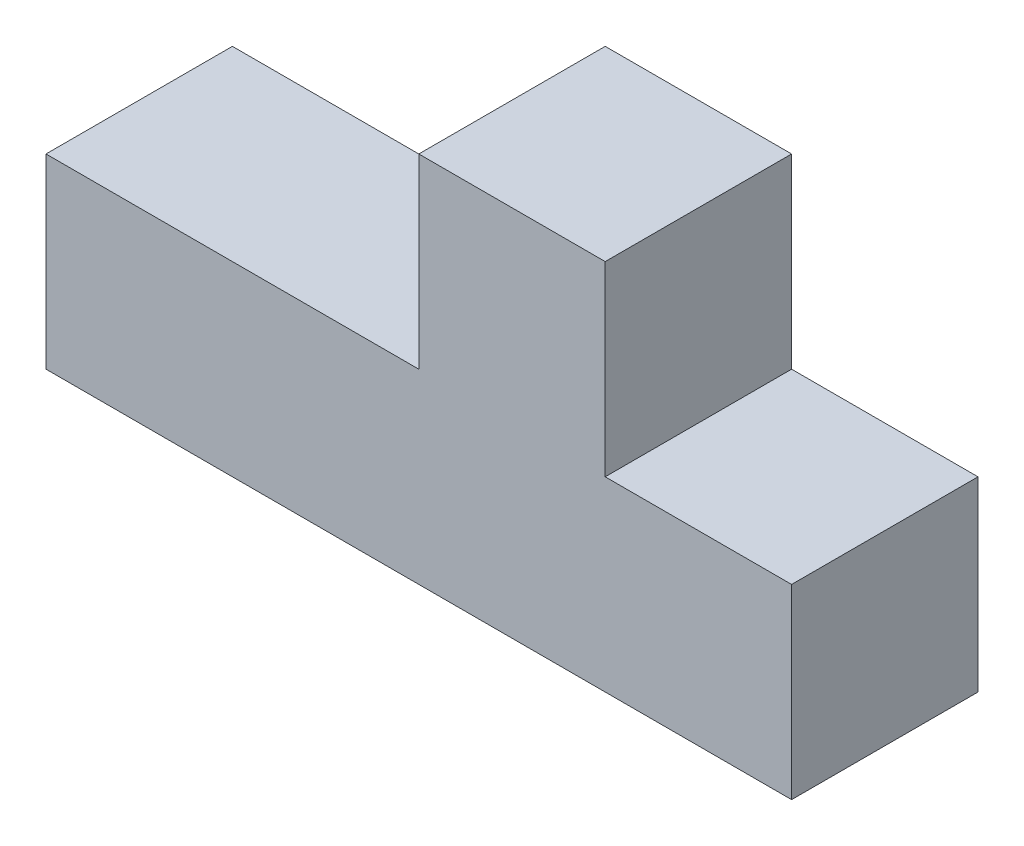
ISO-10303-21;
HEADER;
FILE_DESCRIPTION(('STEP AP214'),'2;1');
FILE_NAME('part.step','',(''),(''),'','','');
FILE_SCHEMA(('AUTOMOTIVE_DESIGN { 1 0 10303 214 1 1 1 1 }'));
ENDSEC;
DATA;
#1=APPLICATION_CONTEXT('core data for automotive mechanical design processes');
#2=APPLICATION_PROTOCOL_DEFINITION('international standard','automotive_design',2000,#1);
#3=PRODUCT_CONTEXT('',#1,'mechanical');
#4=PRODUCT('Part','Part','',(#3));
#5=PRODUCT_RELATED_PRODUCT_CATEGORY('part','',(#4));
#6=PRODUCT_DEFINITION_FORMATION('','',#4);
#7=PRODUCT_DEFINITION_CONTEXT('part definition',#1,'design');
#8=PRODUCT_DEFINITION('design','',#6,#7);
#9=PRODUCT_DEFINITION_SHAPE('','',#8);
#10=(LENGTH_UNIT() NAMED_UNIT(*) SI_UNIT(.MILLI.,.METRE.));
#11=(NAMED_UNIT(*) PLANE_ANGLE_UNIT() SI_UNIT($,.RADIAN.));
#12=(NAMED_UNIT(*) SI_UNIT($,.STERADIAN.) SOLID_ANGLE_UNIT());
#13=UNCERTAINTY_MEASURE_WITH_UNIT(LENGTH_MEASURE(1.E-05),#10,'distance_accuracy_value','');
#14=(GEOMETRIC_REPRESENTATION_CONTEXT(3) GLOBAL_UNCERTAINTY_ASSIGNED_CONTEXT((#13)) GLOBAL_UNIT_ASSIGNED_CONTEXT((#10,
#11,#12)) REPRESENTATION_CONTEXT('',''));
#15=CARTESIAN_POINT('',(0.,0.,0.));
#16=DIRECTION('',(0.,0.,1.));
#17=DIRECTION('',(1.,0.,0.));
#18=AXIS2_PLACEMENT_3D('',#15,#16,#17);
#19=CARTESIAN_POINT('',(0.,25.4,25.4));
#20=DIRECTION('',(1.,0.,0.));
#21=DIRECTION('',(0.,0.,-1.));
#22=AXIS2_PLACEMENT_3D('',#19,#20,#21);
#23=PLANE('',#22);
#24=DIRECTION('',(0.,-1.,0.));
#25=VECTOR('',#24,1.);
#26=CARTESIAN_POINT('',(0.,25.4,0.));
#27=LINE('',#26,#25);
#28=CARTESIAN_POINT('',(0.,25.4,0.));
#29=VERTEX_POINT('',#28);
#30=CARTESIAN_POINT('',(0.,0.,0.));
#31=VERTEX_POINT('',#30);
#32=EDGE_CURVE('E129',#29,#31,#27,.T.);
#33=ORIENTED_EDGE('',*,*,#32,.T.);
#34=DIRECTION('',(0.,0.,-1.));
#35=VECTOR('',#34,1.);
#36=CARTESIAN_POINT('',(0.,0.,25.4));
#37=LINE('',#36,#35);
#38=CARTESIAN_POINT('',(0.,0.,25.4));
#39=VERTEX_POINT('',#38);
#40=EDGE_CURVE('E11',#39,#31,#37,.T.);
#41=ORIENTED_EDGE('',*,*,#40,.F.);
#42=DIRECTION('',(0.,-1.,0.));
#43=VECTOR('',#42,1.);
#44=CARTESIAN_POINT('',(0.,25.4,25.4));
#45=LINE('',#44,#43);
#46=CARTESIAN_POINT('',(0.,25.4,25.4));
#47=VERTEX_POINT('',#46);
#48=EDGE_CURVE('E143',#47,#39,#45,.T.);
#49=ORIENTED_EDGE('',*,*,#48,.F.);
#50=DIRECTION('',(0.,0.,-1.));
#51=VECTOR('',#50,1.);
#52=CARTESIAN_POINT('',(0.,25.4,25.4));
#53=LINE('',#52,#51);
#54=EDGE_CURVE('E125',#47,#29,#53,.T.);
#55=ORIENTED_EDGE('',*,*,#54,.T.);
#56=EDGE_LOOP('',(#33,#41,#49,#55));
#57=FACE_BOUND('',#56,.T.);
#58=ADVANCED_FACE('F33',(#57),#23,.F.);
#59=CARTESIAN_POINT('',(0.,0.,25.4));
#60=DIRECTION('',(0.,1.,0.));
#61=DIRECTION('',(0.,0.,1.));
#62=AXIS2_PLACEMENT_3D('',#59,#60,#61);
#63=PLANE('',#62);
#64=DIRECTION('',(1.,0.,0.));
#65=VECTOR('',#64,1.);
#66=CARTESIAN_POINT('',(0.,0.,0.));
#67=LINE('',#66,#65);
#68=CARTESIAN_POINT('',(101.6,0.,0.));
#69=VERTEX_POINT('',#68);
#70=EDGE_CURVE('E132',#31,#69,#67,.T.);
#71=ORIENTED_EDGE('',*,*,#70,.T.);
#72=DIRECTION('',(0.,0.,-1.));
#73=VECTOR('',#72,1.);
#74=CARTESIAN_POINT('',(101.6,0.,25.4));
#75=LINE('',#74,#73);
#76=CARTESIAN_POINT('',(101.6,0.,25.4));
#77=VERTEX_POINT('',#76);
#78=EDGE_CURVE('E41',#77,#69,#75,.T.);
#79=ORIENTED_EDGE('',*,*,#78,.F.);
#80=DIRECTION('',(1.,0.,0.));
#81=VECTOR('',#80,1.);
#82=CARTESIAN_POINT('',(0.,0.,25.4));
#83=LINE('',#82,#81);
#84=EDGE_CURVE('E92',#39,#77,#83,.T.);
#85=ORIENTED_EDGE('',*,*,#84,.F.);
#86=ORIENTED_EDGE('',*,*,#40,.T.);
#87=EDGE_LOOP('',(#71,#79,#85,#86));
#88=FACE_BOUND('',#87,.T.);
#89=ADVANCED_FACE('F178',(#88),#63,.F.);
#90=CARTESIAN_POINT('',(101.6,0.,25.4));
#91=DIRECTION('',(-1.,0.,0.));
#92=DIRECTION('',(0.,0.,1.));
#93=AXIS2_PLACEMENT_3D('',#90,#91,#92);
#94=PLANE('',#93);
#95=DIRECTION('',(0.,1.,0.));
#96=VECTOR('',#95,1.);
#97=CARTESIAN_POINT('',(101.6,0.,0.));
#98=LINE('',#97,#96);
#99=CARTESIAN_POINT('',(101.6,25.4,0.));
#100=VERTEX_POINT('',#99);
#101=EDGE_CURVE('E134',#69,#100,#98,.T.);
#102=ORIENTED_EDGE('',*,*,#101,.T.);
#103=DIRECTION('',(0.,0.,-1.));
#104=VECTOR('',#103,1.);
#105=CARTESIAN_POINT('',(101.6,25.4,25.4));
#106=LINE('',#105,#104);
#107=CARTESIAN_POINT('',(101.6,25.4,25.4));
#108=VERTEX_POINT('',#107);
#109=EDGE_CURVE('E150',#108,#100,#106,.T.);
#110=ORIENTED_EDGE('',*,*,#109,.F.);
#111=DIRECTION('',(0.,1.,0.));
#112=VECTOR('',#111,1.);
#113=CARTESIAN_POINT('',(101.6,0.,25.4));
#114=LINE('',#113,#112);
#115=EDGE_CURVE('E158',#77,#108,#114,.T.);
#116=ORIENTED_EDGE('',*,*,#115,.F.);
#117=ORIENTED_EDGE('',*,*,#78,.T.);
#118=EDGE_LOOP('',(#102,#110,#116,#117));
#119=FACE_BOUND('',#118,.T.);
#120=ADVANCED_FACE('F156',(#119),#94,.F.);
#121=CARTESIAN_POINT('',(101.6,25.4,25.4));
#122=DIRECTION('',(0.,-1.,0.));
#123=DIRECTION('',(0.,0.,-1.));
#124=AXIS2_PLACEMENT_3D('',#121,#122,#123);
#125=PLANE('',#124);
#126=DIRECTION('',(-1.,0.,0.));
#127=VECTOR('',#126,1.);
#128=CARTESIAN_POINT('',(101.6,25.4,0.));
#129=LINE('',#128,#127);
#130=CARTESIAN_POINT('',(76.2,25.4,0.));
#131=VERTEX_POINT('',#130);
#132=EDGE_CURVE('E136',#100,#131,#129,.T.);
#133=ORIENTED_EDGE('',*,*,#132,.T.);
#134=DIRECTION('',(0.,0.,-1.));
#135=VECTOR('',#134,1.);
#136=CARTESIAN_POINT('',(76.2,25.4,25.4));
#137=LINE('',#136,#135);
#138=CARTESIAN_POINT('',(76.2,25.4,25.4));
#139=VERTEX_POINT('',#138);
#140=EDGE_CURVE('E147',#139,#131,#137,.T.);
#141=ORIENTED_EDGE('',*,*,#140,.F.);
#142=DIRECTION('',(-1.,0.,0.));
#143=VECTOR('',#142,1.);
#144=CARTESIAN_POINT('',(101.6,25.4,25.4));
#145=LINE('',#144,#143);
#146=EDGE_CURVE('E170',#108,#139,#145,.T.);
#147=ORIENTED_EDGE('',*,*,#146,.F.);
#148=ORIENTED_EDGE('',*,*,#109,.T.);
#149=EDGE_LOOP('',(#133,#141,#147,#148));
#150=FACE_BOUND('',#149,.T.);
#151=ADVANCED_FACE('F166',(#150),#125,.F.);
#152=CARTESIAN_POINT('',(76.2,25.4,25.4));
#153=DIRECTION('',(-1.,0.,0.));
#154=DIRECTION('',(0.,0.,1.));
#155=AXIS2_PLACEMENT_3D('',#152,#153,#154);
#156=PLANE('',#155);
#157=DIRECTION('',(0.,1.,0.));
#158=VECTOR('',#157,1.);
#159=CARTESIAN_POINT('',(76.2,25.4,0.));
#160=LINE('',#159,#158);
#161=CARTESIAN_POINT('',(76.2,50.8,0.));
#162=VERTEX_POINT('',#161);
#163=EDGE_CURVE('E138',#131,#162,#160,.T.);
#164=ORIENTED_EDGE('',*,*,#163,.T.);
#165=DIRECTION('',(0.,0.,-1.));
#166=VECTOR('',#165,1.);
#167=CARTESIAN_POINT('',(76.2,50.8,25.4));
#168=LINE('',#167,#166);
#169=CARTESIAN_POINT('',(76.2,50.8,25.4));
#170=VERTEX_POINT('',#169);
#171=EDGE_CURVE('E120',#170,#162,#168,.T.);
#172=ORIENTED_EDGE('',*,*,#171,.F.);
#173=DIRECTION('',(0.,1.,0.));
#174=VECTOR('',#173,1.);
#175=CARTESIAN_POINT('',(76.2,25.4,25.4));
#176=LINE('',#175,#174);
#177=EDGE_CURVE('E111',#139,#170,#176,.T.);
#178=ORIENTED_EDGE('',*,*,#177,.F.);
#179=ORIENTED_EDGE('',*,*,#140,.T.);
#180=EDGE_LOOP('',(#164,#172,#178,#179));
#181=FACE_BOUND('',#180,.T.);
#182=ADVANCED_FACE('F169',(#181),#156,.F.);
#183=CARTESIAN_POINT('',(76.2,50.8,25.4));
#184=DIRECTION('',(0.,-1.,0.));
#185=DIRECTION('',(0.,0.,-1.));
#186=AXIS2_PLACEMENT_3D('',#183,#184,#185);
#187=PLANE('',#186);
#188=DIRECTION('',(-1.,0.,0.));
#189=VECTOR('',#188,1.);
#190=CARTESIAN_POINT('',(76.2,50.8,0.));
#191=LINE('',#190,#189);
#192=CARTESIAN_POINT('',(50.8,50.8,0.));
#193=VERTEX_POINT('',#192);
#194=EDGE_CURVE('E119',#162,#193,#191,.T.);
#195=ORIENTED_EDGE('',*,*,#194,.T.);
#196=DIRECTION('',(0.,0.,-1.));
#197=VECTOR('',#196,1.);
#198=CARTESIAN_POINT('',(50.8,50.8,25.4));
#199=LINE('',#198,#197);
#200=CARTESIAN_POINT('',(50.8,50.8,25.4));
#201=VERTEX_POINT('',#200);
#202=EDGE_CURVE('E116',#201,#193,#199,.T.);
#203=ORIENTED_EDGE('',*,*,#202,.F.);
#204=DIRECTION('',(-1.,0.,0.));
#205=VECTOR('',#204,1.);
#206=CARTESIAN_POINT('',(76.2,50.8,25.4));
#207=LINE('',#206,#205);
#208=EDGE_CURVE('E105',#170,#201,#207,.T.);
#209=ORIENTED_EDGE('',*,*,#208,.F.);
#210=ORIENTED_EDGE('',*,*,#171,.T.);
#211=EDGE_LOOP('',(#195,#203,#209,#210));
#212=FACE_BOUND('',#211,.T.);
#213=ADVANCED_FACE('F117',(#212),#187,.F.);
#214=CARTESIAN_POINT('',(50.8,50.8,25.4));
#215=DIRECTION('',(1.,0.,0.));
#216=DIRECTION('',(0.,0.,-1.));
#217=AXIS2_PLACEMENT_3D('',#214,#215,#216);
#218=PLANE('',#217);
#219=DIRECTION('',(0.,-1.,0.));
#220=VECTOR('',#219,1.);
#221=CARTESIAN_POINT('',(50.8,50.8,0.));
#222=LINE('',#221,#220);
#223=CARTESIAN_POINT('',(50.8,25.4,0.));
#224=VERTEX_POINT('',#223);
#225=EDGE_CURVE('E78',#193,#224,#222,.T.);
#226=ORIENTED_EDGE('',*,*,#225,.T.);
#227=DIRECTION('',(0.,0.,-1.));
#228=VECTOR('',#227,1.);
#229=CARTESIAN_POINT('',(50.8,25.4,25.4));
#230=LINE('',#229,#228);
#231=CARTESIAN_POINT('',(50.8,25.4,25.4));
#232=VERTEX_POINT('',#231);
#233=EDGE_CURVE('E121',#232,#224,#230,.T.);
#234=ORIENTED_EDGE('',*,*,#233,.F.);
#235=DIRECTION('',(0.,-1.,0.));
#236=VECTOR('',#235,1.);
#237=CARTESIAN_POINT('',(50.8,50.8,25.4));
#238=LINE('',#237,#236);
#239=EDGE_CURVE('E109',#201,#232,#238,.T.);
#240=ORIENTED_EDGE('',*,*,#239,.F.);
#241=ORIENTED_EDGE('',*,*,#202,.T.);
#242=EDGE_LOOP('',(#226,#234,#240,#241));
#243=FACE_BOUND('',#242,.T.);
#244=ADVANCED_FACE('F123',(#243),#218,.F.);
#245=CARTESIAN_POINT('',(50.8,25.4,25.4));
#246=DIRECTION('',(0.,-1.,0.));
#247=DIRECTION('',(0.,0.,-1.));
#248=AXIS2_PLACEMENT_3D('',#245,#246,#247);
#249=PLANE('',#248);
#250=DIRECTION('',(-1.,0.,0.));
#251=VECTOR('',#250,1.);
#252=CARTESIAN_POINT('',(50.8,25.4,0.));
#253=LINE('',#252,#251);
#254=EDGE_CURVE('E84',#224,#29,#253,.T.);
#255=ORIENTED_EDGE('',*,*,#254,.T.);
#256=ORIENTED_EDGE('',*,*,#54,.F.);
#257=DIRECTION('',(-1.,0.,0.));
#258=VECTOR('',#257,1.);
#259=CARTESIAN_POINT('',(50.8,25.4,25.4));
#260=LINE('',#259,#258);
#261=EDGE_CURVE('E49',#232,#47,#260,.T.);
#262=ORIENTED_EDGE('',*,*,#261,.F.);
#263=ORIENTED_EDGE('',*,*,#233,.T.);
#264=EDGE_LOOP('',(#255,#256,#262,#263));
#265=FACE_BOUND('',#264,.T.);
#266=ADVANCED_FACE('F194',(#265),#249,.F.);
#267=CARTESIAN_POINT('',(0.,0.,25.4));
#268=DIRECTION('',(0.,0.,1.));
#269=DIRECTION('',(1.,0.,0.));
#270=AXIS2_PLACEMENT_3D('',#267,#268,#269);
#271=PLANE('',#270);
#272=ORIENTED_EDGE('',*,*,#48,.T.);
#273=ORIENTED_EDGE('',*,*,#84,.T.);
#274=ORIENTED_EDGE('',*,*,#115,.T.);
#275=ORIENTED_EDGE('',*,*,#146,.T.);
#276=ORIENTED_EDGE('',*,*,#177,.T.);
#277=ORIENTED_EDGE('',*,*,#208,.T.);
#278=ORIENTED_EDGE('',*,*,#239,.T.);
#279=ORIENTED_EDGE('',*,*,#261,.T.);
#280=EDGE_LOOP('',(#272,#273,#274,#275,#276,#277,#278,#279));
#281=FACE_BOUND('',#280,.T.);
#282=ADVANCED_FACE('F107',(#281),#271,.T.);
#283=CARTESIAN_POINT('',(0.,0.,0.));
#284=DIRECTION('',(0.,0.,1.));
#285=DIRECTION('',(1.,0.,0.));
#286=AXIS2_PLACEMENT_3D('',#283,#284,#285);
#287=PLANE('',#286);
#288=ORIENTED_EDGE('',*,*,#32,.F.);
#289=ORIENTED_EDGE('',*,*,#254,.F.);
#290=ORIENTED_EDGE('',*,*,#225,.F.);
#291=ORIENTED_EDGE('',*,*,#194,.F.);
#292=ORIENTED_EDGE('',*,*,#163,.F.);
#293=ORIENTED_EDGE('',*,*,#132,.F.);
#294=ORIENTED_EDGE('',*,*,#101,.F.);
#295=ORIENTED_EDGE('',*,*,#70,.F.);
#296=EDGE_LOOP('',(#288,#289,#290,#291,#292,#293,#294,#295));
#297=FACE_BOUND('',#296,.T.);
#298=ADVANCED_FACE('F162',(#297),#287,.F.);
#299=CLOSED_SHELL('',(#58,#89,#120,#151,#182,#213,#244,#266,#282,#298));
#300=MANIFOLD_SOLID_BREP('B2',#299);
#301=ADVANCED_BREP_SHAPE_REPRESENTATION('',(#18,#300),#14);
#302=SHAPE_DEFINITION_REPRESENTATION(#9,#301);
ENDSEC;
END-ISO-10303-21;
